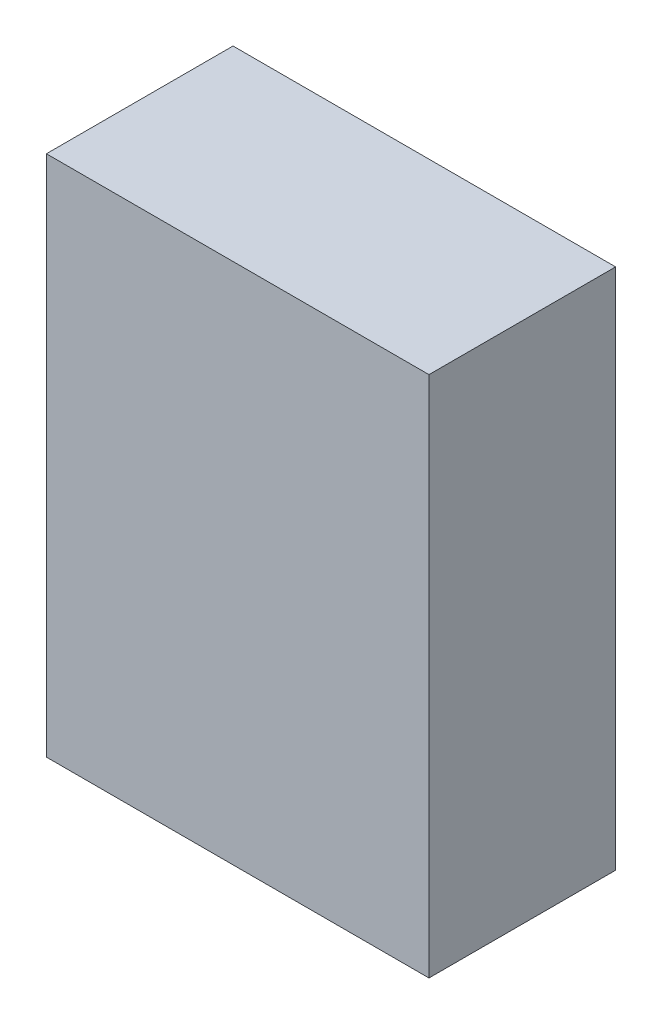
ISO-10303-21;
HEADER;
FILE_DESCRIPTION(('STEP AP214'),'2;1');
FILE_NAME('part.step','',(''),(''),'','','');
FILE_SCHEMA(('AUTOMOTIVE_DESIGN { 1 0 10303 214 1 1 1 1 }'));
ENDSEC;
DATA;
#1=APPLICATION_CONTEXT('core data for automotive mechanical design processes');
#2=APPLICATION_PROTOCOL_DEFINITION('international standard','automotive_design',2000,#1);
#3=PRODUCT_CONTEXT('',#1,'mechanical');
#4=PRODUCT('Part','Part','',(#3));
#5=PRODUCT_RELATED_PRODUCT_CATEGORY('part','',(#4));
#6=PRODUCT_DEFINITION_FORMATION('','',#4);
#7=PRODUCT_DEFINITION_CONTEXT('part definition',#1,'design');
#8=PRODUCT_DEFINITION('design','',#6,#7);
#9=PRODUCT_DEFINITION_SHAPE('','',#8);
#10=(LENGTH_UNIT() NAMED_UNIT(*) SI_UNIT(.MILLI.,.METRE.));
#11=(NAMED_UNIT(*) PLANE_ANGLE_UNIT() SI_UNIT($,.RADIAN.));
#12=(NAMED_UNIT(*) SI_UNIT($,.STERADIAN.) SOLID_ANGLE_UNIT());
#13=UNCERTAINTY_MEASURE_WITH_UNIT(LENGTH_MEASURE(1.E-05),#10,'distance_accuracy_value','');
#14=(GEOMETRIC_REPRESENTATION_CONTEXT(3) GLOBAL_UNCERTAINTY_ASSIGNED_CONTEXT((#13)) GLOBAL_UNIT_ASSIGNED_CONTEXT((#10,
#11,#12)) REPRESENTATION_CONTEXT('',''));
#15=CARTESIAN_POINT('',(0.,0.,0.));
#16=DIRECTION('',(0.,0.,1.));
#17=DIRECTION('',(1.,0.,0.));
#18=AXIS2_PLACEMENT_3D('',#15,#16,#17);
#19=CARTESIAN_POINT('',(0.,0.,0.2));
#20=DIRECTION('',(0.,0.,1.));
#21=DIRECTION('',(1.,0.,0.));
#22=AXIS2_PLACEMENT_3D('',#19,#20,#21);
#23=PLANE('',#22);
#24=DIRECTION('',(0.,-1.,0.));
#25=VECTOR('',#24,1.);
#26=CARTESIAN_POINT('',(1.7,-2.44,0.2));
#27=LINE('',#26,#25);
#28=CARTESIAN_POINT('',(1.7,-3.,0.2));
#29=VERTEX_POINT('',#28);
#30=CARTESIAN_POINT('',(1.7,-2.44,0.2));
#31=VERTEX_POINT('',#30);
#32=EDGE_CURVE('E68',#29,#31,#27,.F.);
#33=ORIENTED_EDGE('',*,*,#32,.F.);
#34=DIRECTION('',(1.,0.,0.));
#35=VECTOR('',#34,1.);
#36=CARTESIAN_POINT('',(1.7,-3.,0.2));
#37=LINE('',#36,#35);
#38=CARTESIAN_POINT('',(2.11,-3.,0.2));
#39=VERTEX_POINT('',#38);
#40=EDGE_CURVE('E20',#39,#29,#37,.F.);
#41=ORIENTED_EDGE('',*,*,#40,.F.);
#42=DIRECTION('',(0.,1.,0.));
#43=VECTOR('',#42,1.);
#44=CARTESIAN_POINT('',(2.11,-3.,0.2));
#45=LINE('',#44,#43);
#46=CARTESIAN_POINT('',(2.11,-2.44,0.2));
#47=VERTEX_POINT('',#46);
#48=EDGE_CURVE('E58',#47,#39,#45,.F.);
#49=ORIENTED_EDGE('',*,*,#48,.F.);
#50=DIRECTION('',(-1.,0.,0.));
#51=VECTOR('',#50,1.);
#52=CARTESIAN_POINT('',(2.11,-2.44,0.2));
#53=LINE('',#52,#51);
#54=EDGE_CURVE('E53',#31,#47,#53,.F.);
#55=ORIENTED_EDGE('',*,*,#54,.F.);
#56=EDGE_LOOP('',(#33,#41,#49,#55));
#57=FACE_BOUND('',#56,.T.);
#58=ADVANCED_FACE('F17',(#57),#23,.T.);
#59=CARTESIAN_POINT('',(1.7,-3.,0.));
#60=DIRECTION('',(0.,-1.,0.));
#61=DIRECTION('',(1.,0.,0.));
#62=AXIS2_PLACEMENT_3D('',#59,#60,#61);
#63=PLANE('',#62);
#64=DIRECTION('',(0.,0.,1.));
#65=VECTOR('',#64,1.);
#66=CARTESIAN_POINT('',(1.7,-3.,0.));
#67=LINE('',#66,#65);
#68=CARTESIAN_POINT('',(1.7,-3.,0.));
#69=VERTEX_POINT('',#68);
#70=EDGE_CURVE('E79',#69,#29,#67,.T.);
#71=ORIENTED_EDGE('',*,*,#70,.F.);
#72=DIRECTION('',(1.,0.,0.));
#73=VECTOR('',#72,1.);
#74=CARTESIAN_POINT('',(0.,-3.,0.));
#75=LINE('',#74,#73);
#76=CARTESIAN_POINT('',(2.11,-3.,0.));
#77=VERTEX_POINT('',#76);
#78=EDGE_CURVE('E74',#69,#77,#75,.T.);
#79=ORIENTED_EDGE('',*,*,#78,.T.);
#80=DIRECTION('',(0.,0.,1.));
#81=VECTOR('',#80,1.);
#82=CARTESIAN_POINT('',(2.11,-3.,0.));
#83=LINE('',#82,#81);
#84=EDGE_CURVE('E63',#39,#77,#83,.F.);
#85=ORIENTED_EDGE('',*,*,#84,.F.);
#86=ORIENTED_EDGE('',*,*,#40,.T.);
#87=EDGE_LOOP('',(#71,#79,#85,#86));
#88=FACE_BOUND('',#87,.T.);
#89=ADVANCED_FACE('F73',(#88),#63,.T.);
#90=CARTESIAN_POINT('',(2.11,-3.,0.));
#91=DIRECTION('',(1.,0.,0.));
#92=DIRECTION('',(0.,1.,0.));
#93=AXIS2_PLACEMENT_3D('',#90,#91,#92);
#94=PLANE('',#93);
#95=ORIENTED_EDGE('',*,*,#84,.T.);
#96=DIRECTION('',(0.,1.,0.));
#97=VECTOR('',#96,1.);
#98=CARTESIAN_POINT('',(2.11,0.,0.));
#99=LINE('',#98,#97);
#100=CARTESIAN_POINT('',(2.11,-2.44,0.));
#101=VERTEX_POINT('',#100);
#102=EDGE_CURVE('E84',#77,#101,#99,.T.);
#103=ORIENTED_EDGE('',*,*,#102,.T.);
#104=DIRECTION('',(0.,0.,1.));
#105=VECTOR('',#104,1.);
#106=CARTESIAN_POINT('',(2.11,-2.44,0.));
#107=LINE('',#106,#105);
#108=EDGE_CURVE('E65',#47,#101,#107,.F.);
#109=ORIENTED_EDGE('',*,*,#108,.F.);
#110=ORIENTED_EDGE('',*,*,#48,.T.);
#111=EDGE_LOOP('',(#95,#103,#109,#110));
#112=FACE_BOUND('',#111,.T.);
#113=ADVANCED_FACE('F60',(#112),#94,.T.);
#114=CARTESIAN_POINT('',(2.11,-2.44,0.));
#115=DIRECTION('',(0.,1.,0.));
#116=DIRECTION('',(-1.,0.,0.));
#117=AXIS2_PLACEMENT_3D('',#114,#115,#116);
#118=PLANE('',#117);
#119=ORIENTED_EDGE('',*,*,#108,.T.);
#120=DIRECTION('',(1.,0.,0.));
#121=VECTOR('',#120,1.);
#122=CARTESIAN_POINT('',(0.,-2.44,0.));
#123=LINE('',#122,#121);
#124=CARTESIAN_POINT('',(1.7,-2.44,0.));
#125=VERTEX_POINT('',#124);
#126=EDGE_CURVE('E26',#101,#125,#123,.F.);
#127=ORIENTED_EDGE('',*,*,#126,.T.);
#128=DIRECTION('',(0.,0.,1.));
#129=VECTOR('',#128,1.);
#130=CARTESIAN_POINT('',(1.7,-2.44,0.));
#131=LINE('',#130,#129);
#132=EDGE_CURVE('E34',#31,#125,#131,.F.);
#133=ORIENTED_EDGE('',*,*,#132,.F.);
#134=ORIENTED_EDGE('',*,*,#54,.T.);
#135=EDGE_LOOP('',(#119,#127,#133,#134));
#136=FACE_BOUND('',#135,.T.);
#137=ADVANCED_FACE('F88',(#136),#118,.T.);
#138=CARTESIAN_POINT('',(1.7,-2.44,0.));
#139=DIRECTION('',(-1.,0.,0.));
#140=DIRECTION('',(0.,-1.,0.));
#141=AXIS2_PLACEMENT_3D('',#138,#139,#140);
#142=PLANE('',#141);
#143=ORIENTED_EDGE('',*,*,#132,.T.);
#144=DIRECTION('',(0.,1.,0.));
#145=VECTOR('',#144,1.);
#146=CARTESIAN_POINT('',(1.7,0.,0.));
#147=LINE('',#146,#145);
#148=EDGE_CURVE('E11',#125,#69,#147,.F.);
#149=ORIENTED_EDGE('',*,*,#148,.T.);
#150=ORIENTED_EDGE('',*,*,#70,.T.);
#151=ORIENTED_EDGE('',*,*,#32,.T.);
#152=EDGE_LOOP('',(#143,#149,#150,#151));
#153=FACE_BOUND('',#152,.T.);
#154=ADVANCED_FACE('F91',(#153),#142,.T.);
#155=CARTESIAN_POINT('',(0.,0.,0.));
#156=DIRECTION('',(0.,0.,1.));
#157=DIRECTION('',(1.,0.,0.));
#158=AXIS2_PLACEMENT_3D('',#155,#156,#157);
#159=PLANE('',#158);
#160=ORIENTED_EDGE('',*,*,#126,.F.);
#161=ORIENTED_EDGE('',*,*,#102,.F.);
#162=ORIENTED_EDGE('',*,*,#78,.F.);
#163=ORIENTED_EDGE('',*,*,#148,.F.);
#164=EDGE_LOOP('',(#160,#161,#162,#163));
#165=FACE_BOUND('',#164,.T.);
#166=ADVANCED_FACE('F90',(#165),#159,.F.);
#167=CLOSED_SHELL('',(#58,#89,#113,#137,#154,#166));
#168=MANIFOLD_SOLID_BREP('B1',#167);
#169=ADVANCED_BREP_SHAPE_REPRESENTATION('',(#18,#168),#14);
#170=SHAPE_DEFINITION_REPRESENTATION(#9,#169);
ENDSEC;
END-ISO-10303-21;
